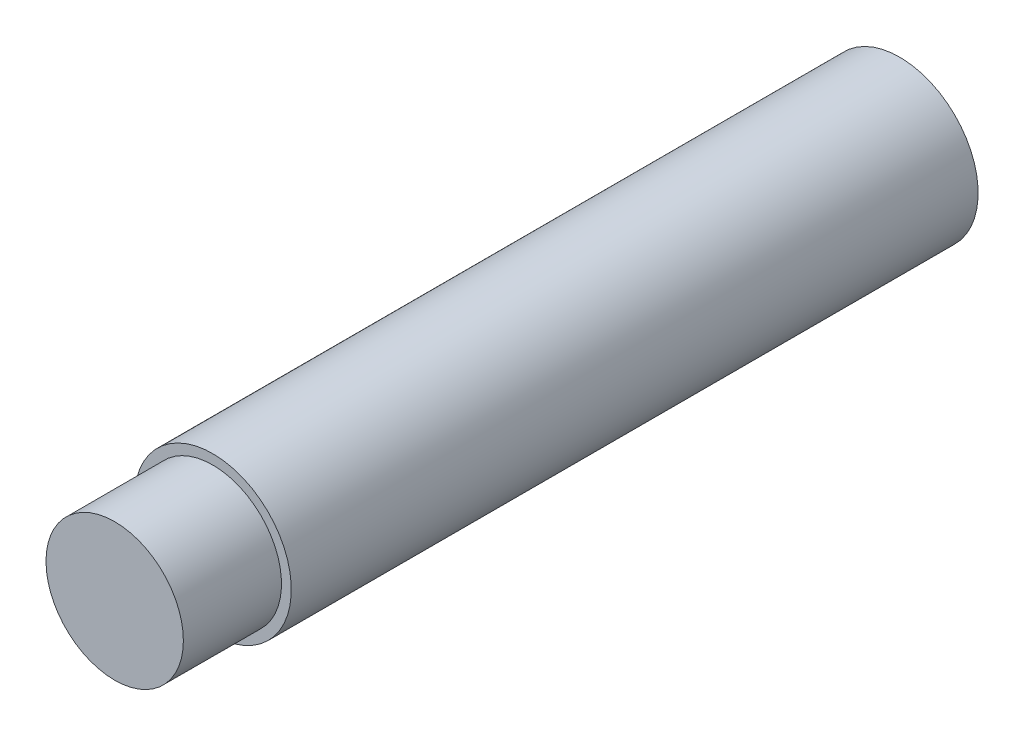
ISO-10303-21;
HEADER;
FILE_DESCRIPTION(('STEP AP214'),'2;1');
FILE_NAME('part.step','',(''),(''),'','','');
FILE_SCHEMA(('AUTOMOTIVE_DESIGN { 1 0 10303 214 1 1 1 1 }'));
ENDSEC;
DATA;
#1=APPLICATION_CONTEXT('core data for automotive mechanical design processes');
#2=APPLICATION_PROTOCOL_DEFINITION('international standard','automotive_design',2000,#1);
#3=PRODUCT_CONTEXT('',#1,'mechanical');
#4=PRODUCT('Part','Part','',(#3));
#5=PRODUCT_RELATED_PRODUCT_CATEGORY('part','',(#4));
#6=PRODUCT_DEFINITION_FORMATION('','',#4);
#7=PRODUCT_DEFINITION_CONTEXT('part definition',#1,'design');
#8=PRODUCT_DEFINITION('design','',#6,#7);
#9=PRODUCT_DEFINITION_SHAPE('','',#8);
#10=(LENGTH_UNIT() NAMED_UNIT(*) SI_UNIT(.MILLI.,.METRE.));
#11=(NAMED_UNIT(*) PLANE_ANGLE_UNIT() SI_UNIT($,.RADIAN.));
#12=(NAMED_UNIT(*) SI_UNIT($,.STERADIAN.) SOLID_ANGLE_UNIT());
#13=UNCERTAINTY_MEASURE_WITH_UNIT(LENGTH_MEASURE(1.E-05),#10,'distance_accuracy_value','');
#14=(GEOMETRIC_REPRESENTATION_CONTEXT(3) GLOBAL_UNCERTAINTY_ASSIGNED_CONTEXT((#13)) GLOBAL_UNIT_ASSIGNED_CONTEXT((#10,
#11,#12)) REPRESENTATION_CONTEXT('',''));
#15=CARTESIAN_POINT('',(0.,0.,0.));
#16=DIRECTION('',(0.,0.,1.));
#17=DIRECTION('',(1.,0.,0.));
#18=AXIS2_PLACEMENT_3D('',#15,#16,#17);
#19=CARTESIAN_POINT('',(0.,0.,7.5));
#20=DIRECTION('',(0.,0.,-1.));
#21=DIRECTION('',(-1.,0.,0.));
#22=AXIS2_PLACEMENT_3D('',#19,#20,#21);
#23=CYLINDRICAL_SURFACE('',#22,5.25);
#24=CARTESIAN_POINT('',(0.,0.,7.5));
#25=DIRECTION('',(0.,0.,1.));
#26=DIRECTION('',(1.,0.,0.));
#27=AXIS2_PLACEMENT_3D('',#24,#25,#26);
#28=CIRCLE('',#27,5.25);
#29=CARTESIAN_POINT('',(5.25,0.,7.5));
#30=VERTEX_POINT('',#29);
#31=EDGE_CURVE('E10',#30,#30,#28,.T.);
#32=ORIENTED_EDGE('',*,*,#31,.F.);
#33=EDGE_LOOP('',(#32));
#34=FACE_BOUND('',#33,.T.);
#35=CARTESIAN_POINT('',(0.,0.,0.));
#36=DIRECTION('',(0.,0.,-1.));
#37=DIRECTION('',(-1.,0.,0.));
#38=AXIS2_PLACEMENT_3D('',#35,#36,#37);
#39=CIRCLE('',#38,5.25);
#40=CARTESIAN_POINT('',(-5.25,0.,0.));
#41=VERTEX_POINT('',#40);
#42=EDGE_CURVE('E42',#41,#41,#39,.T.);
#43=ORIENTED_EDGE('',*,*,#42,.F.);
#44=EDGE_LOOP('',(#43));
#45=FACE_BOUND('',#44,.T.);
#46=ADVANCED_FACE('F36',(#34,#45),#23,.T.);
#47=CARTESIAN_POINT('',(0.,0.,7.5));
#48=DIRECTION('',(0.,0.,1.));
#49=DIRECTION('',(1.,0.,0.));
#50=AXIS2_PLACEMENT_3D('',#47,#48,#49);
#51=PLANE('',#50);
#52=ORIENTED_EDGE('',*,*,#31,.T.);
#53=EDGE_LOOP('',(#52));
#54=FACE_BOUND('',#53,.T.);
#55=ADVANCED_FACE('F61',(#54),#51,.T.);
#56=CARTESIAN_POINT('',(0.,0.,-42.5));
#57=DIRECTION('',(0.,0.,1.));
#58=DIRECTION('',(1.,0.,0.));
#59=AXIS2_PLACEMENT_3D('',#56,#57,#58);
#60=CYLINDRICAL_SURFACE('',#59,6.);
#61=CARTESIAN_POINT('',(0.,0.,0.));
#62=DIRECTION('',(0.,0.,-1.));
#63=DIRECTION('',(-1.,0.,0.));
#64=AXIS2_PLACEMENT_3D('',#61,#62,#63);
#65=CIRCLE('',#64,6.);
#66=CARTESIAN_POINT('',(-6.,0.,0.));
#67=VERTEX_POINT('',#66);
#68=EDGE_CURVE('E46',#67,#67,#65,.T.);
#69=ORIENTED_EDGE('',*,*,#68,.T.);
#70=EDGE_LOOP('',(#69));
#71=FACE_BOUND('',#70,.T.);
#72=CARTESIAN_POINT('',(0.,0.,-52.5));
#73=DIRECTION('',(0.,0.,-1.));
#74=DIRECTION('',(-1.,0.,0.));
#75=AXIS2_PLACEMENT_3D('',#72,#73,#74);
#76=CIRCLE('',#75,6.);
#77=CARTESIAN_POINT('',(-6.,0.,-52.5));
#78=VERTEX_POINT('',#77);
#79=EDGE_CURVE('E50',#78,#78,#76,.T.);
#80=ORIENTED_EDGE('',*,*,#79,.F.);
#81=EDGE_LOOP('',(#80));
#82=FACE_BOUND('',#81,.T.);
#83=ADVANCED_FACE('F58',(#71,#82),#60,.T.);
#84=CARTESIAN_POINT('',(0.,0.,0.));
#85=DIRECTION('',(0.,0.,-1.));
#86=DIRECTION('',(-1.,0.,0.));
#87=AXIS2_PLACEMENT_3D('',#84,#85,#86);
#88=PLANE('',#87);
#89=ORIENTED_EDGE('',*,*,#42,.T.);
#90=EDGE_LOOP('',(#89));
#91=FACE_BOUND('',#90,.T.);
#92=ORIENTED_EDGE('',*,*,#68,.F.);
#93=EDGE_LOOP('',(#92));
#94=FACE_BOUND('',#93,.T.);
#95=ADVANCED_FACE('F60',(#91,#94),#88,.F.);
#96=CARTESIAN_POINT('',(0.,0.,-52.5));
#97=DIRECTION('',(0.,0.,-1.));
#98=DIRECTION('',(-1.,0.,0.));
#99=AXIS2_PLACEMENT_3D('',#96,#97,#98);
#100=PLANE('',#99);
#101=ORIENTED_EDGE('',*,*,#79,.T.);
#102=EDGE_LOOP('',(#101));
#103=FACE_BOUND('',#102,.T.);
#104=ADVANCED_FACE('F56',(#103),#100,.T.);
#105=CLOSED_SHELL('',(#46,#55,#83,#95,#104));
#106=MANIFOLD_SOLID_BREP('B2',#105);
#107=ADVANCED_BREP_SHAPE_REPRESENTATION('',(#18,#106),#14);
#108=SHAPE_DEFINITION_REPRESENTATION(#9,#107);
ENDSEC;
END-ISO-10303-21;
